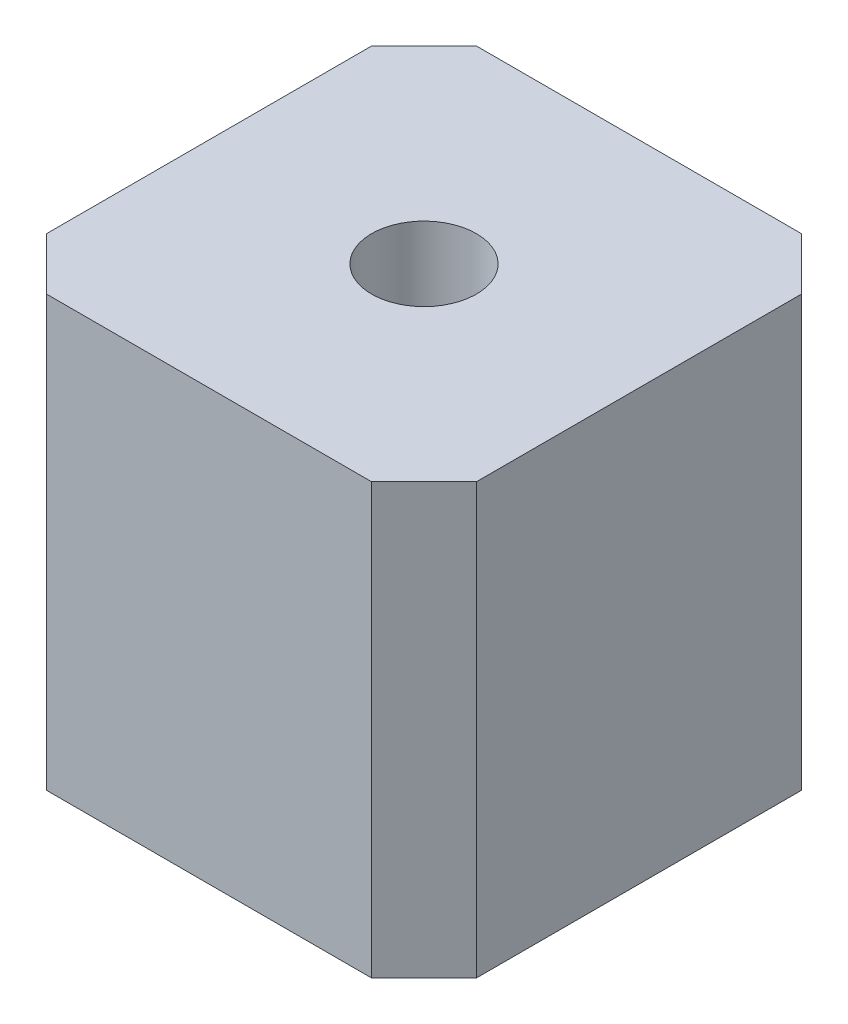
ISO-10303-21;
HEADER;
FILE_DESCRIPTION(('STEP AP214'),'2;1');
FILE_NAME('part.step','',(''),(''),'','','');
FILE_SCHEMA(('AUTOMOTIVE_DESIGN { 1 0 10303 214 1 1 1 1 }'));
ENDSEC;
DATA;
#1=APPLICATION_CONTEXT('core data for automotive mechanical design processes');
#2=APPLICATION_PROTOCOL_DEFINITION('international standard','automotive_design',2000,#1);
#3=PRODUCT_CONTEXT('',#1,'mechanical');
#4=PRODUCT('Part','Part','',(#3));
#5=PRODUCT_RELATED_PRODUCT_CATEGORY('part','',(#4));
#6=PRODUCT_DEFINITION_FORMATION('','',#4);
#7=PRODUCT_DEFINITION_CONTEXT('part definition',#1,'design');
#8=PRODUCT_DEFINITION('design','',#6,#7);
#9=PRODUCT_DEFINITION_SHAPE('','',#8);
#10=(LENGTH_UNIT() NAMED_UNIT(*) SI_UNIT(.MILLI.,.METRE.));
#11=(NAMED_UNIT(*) PLANE_ANGLE_UNIT() SI_UNIT($,.RADIAN.));
#12=(NAMED_UNIT(*) SI_UNIT($,.STERADIAN.) SOLID_ANGLE_UNIT());
#13=UNCERTAINTY_MEASURE_WITH_UNIT(LENGTH_MEASURE(1.E-05),#10,'distance_accuracy_value','');
#14=(GEOMETRIC_REPRESENTATION_CONTEXT(3) GLOBAL_UNCERTAINTY_ASSIGNED_CONTEXT((#13)) GLOBAL_UNIT_ASSIGNED_CONTEXT((#10,
#11,#12)) REPRESENTATION_CONTEXT('',''));
#15=CARTESIAN_POINT('',(0.,0.,0.));
#16=DIRECTION('',(0.,0.,1.));
#17=DIRECTION('',(1.,0.,0.));
#18=AXIS2_PLACEMENT_3D('',#15,#16,#17);
#19=CARTESIAN_POINT('',(20.5,41.,20.5));
#20=DIRECTION('',(-1.,0.,0.));
#21=DIRECTION('',(0.,0.,1.));
#22=AXIS2_PLACEMENT_3D('',#19,#20,#21);
#23=PLANE('',#22);
#24=DIRECTION('',(0.,0.,-1.));
#25=VECTOR('',#24,1.);
#26=CARTESIAN_POINT('',(20.5,41.,20.5));
#27=LINE('',#26,#25);
#28=CARTESIAN_POINT('',(20.5,41.,15.5));
#29=VERTEX_POINT('',#28);
#30=CARTESIAN_POINT('',(20.5,41.,-15.5));
#31=VERTEX_POINT('',#30);
#32=EDGE_CURVE('E126',#29,#31,#27,.T.);
#33=ORIENTED_EDGE('',*,*,#32,.F.);
#34=DIRECTION('',(0.,-1.,0.));
#35=VECTOR('',#34,1.);
#36=CARTESIAN_POINT('',(20.5,41.,15.5));
#37=LINE('',#36,#35);
#38=CARTESIAN_POINT('',(20.5,0.,15.5));
#39=VERTEX_POINT('',#38);
#40=EDGE_CURVE('E111',#29,#39,#37,.T.);
#41=ORIENTED_EDGE('',*,*,#40,.T.);
#42=DIRECTION('',(0.,0.,-1.));
#43=VECTOR('',#42,1.);
#44=CARTESIAN_POINT('',(20.5,0.,20.5));
#45=LINE('',#44,#43);
#46=CARTESIAN_POINT('',(20.5,0.,-15.5));
#47=VERTEX_POINT('',#46);
#48=EDGE_CURVE('E123',#39,#47,#45,.T.);
#49=ORIENTED_EDGE('',*,*,#48,.T.);
#50=DIRECTION('',(0.,1.,0.));
#51=VECTOR('',#50,1.);
#52=CARTESIAN_POINT('',(20.5,41.,-15.5));
#53=LINE('',#52,#51);
#54=EDGE_CURVE('E128',#47,#31,#53,.T.);
#55=ORIENTED_EDGE('',*,*,#54,.T.);
#56=EDGE_LOOP('',(#33,#41,#49,#55));
#57=FACE_BOUND('',#56,.T.);
#58=ADVANCED_FACE('F41',(#57),#23,.F.);
#59=CARTESIAN_POINT('',(-20.5,41.,-20.5));
#60=DIRECTION('',(0.,0.,1.));
#61=DIRECTION('',(1.,0.,0.));
#62=AXIS2_PLACEMENT_3D('',#59,#60,#61);
#63=PLANE('',#62);
#64=DIRECTION('',(-1.,0.,0.));
#65=VECTOR('',#64,1.);
#66=CARTESIAN_POINT('',(-20.5,41.,-20.5));
#67=LINE('',#66,#65);
#68=CARTESIAN_POINT('',(15.5,41.,-20.5));
#69=VERTEX_POINT('',#68);
#70=CARTESIAN_POINT('',(-15.5,41.,-20.5));
#71=VERTEX_POINT('',#70);
#72=EDGE_CURVE('E181',#69,#71,#67,.T.);
#73=ORIENTED_EDGE('',*,*,#72,.F.);
#74=DIRECTION('',(0.,-1.,0.));
#75=VECTOR('',#74,1.);
#76=CARTESIAN_POINT('',(15.5,41.,-20.5));
#77=LINE('',#76,#75);
#78=CARTESIAN_POINT('',(15.5,0.,-20.5));
#79=VERTEX_POINT('',#78);
#80=EDGE_CURVE('E165',#69,#79,#77,.T.);
#81=ORIENTED_EDGE('',*,*,#80,.T.);
#82=DIRECTION('',(-1.,0.,0.));
#83=VECTOR('',#82,1.);
#84=CARTESIAN_POINT('',(-20.5,0.,-20.5));
#85=LINE('',#84,#83);
#86=CARTESIAN_POINT('',(-15.5,0.,-20.5));
#87=VERTEX_POINT('',#86);
#88=EDGE_CURVE('E132',#79,#87,#85,.T.);
#89=ORIENTED_EDGE('',*,*,#88,.T.);
#90=DIRECTION('',(0.,1.,0.));
#91=VECTOR('',#90,1.);
#92=CARTESIAN_POINT('',(-15.5,41.,-20.5));
#93=LINE('',#92,#91);
#94=EDGE_CURVE('E163',#87,#71,#93,.T.);
#95=ORIENTED_EDGE('',*,*,#94,.T.);
#96=EDGE_LOOP('',(#73,#81,#89,#95));
#97=FACE_BOUND('',#96,.T.);
#98=ADVANCED_FACE('F203',(#97),#63,.F.);
#99=CARTESIAN_POINT('',(-20.5,41.,20.5));
#100=DIRECTION('',(1.,0.,0.));
#101=DIRECTION('',(0.,0.,-1.));
#102=AXIS2_PLACEMENT_3D('',#99,#100,#101);
#103=PLANE('',#102);
#104=DIRECTION('',(0.,0.,1.));
#105=VECTOR('',#104,1.);
#106=CARTESIAN_POINT('',(-20.5,0.,20.5));
#107=LINE('',#106,#105);
#108=CARTESIAN_POINT('',(-20.5,0.,-15.5));
#109=VERTEX_POINT('',#108);
#110=CARTESIAN_POINT('',(-20.5,0.,15.5));
#111=VERTEX_POINT('',#110);
#112=EDGE_CURVE('E136',#109,#111,#107,.T.);
#113=ORIENTED_EDGE('',*,*,#112,.T.);
#114=DIRECTION('',(0.,1.,0.));
#115=VECTOR('',#114,1.);
#116=CARTESIAN_POINT('',(-20.5,41.,15.5));
#117=LINE('',#116,#115);
#118=CARTESIAN_POINT('',(-20.5,41.,15.5));
#119=VERTEX_POINT('',#118);
#120=EDGE_CURVE('E11',#111,#119,#117,.T.);
#121=ORIENTED_EDGE('',*,*,#120,.T.);
#122=DIRECTION('',(0.,0.,1.));
#123=VECTOR('',#122,1.);
#124=CARTESIAN_POINT('',(-20.5,41.,20.5));
#125=LINE('',#124,#123);
#126=CARTESIAN_POINT('',(-20.5,41.,-15.5));
#127=VERTEX_POINT('',#126);
#128=EDGE_CURVE('E171',#127,#119,#125,.T.);
#129=ORIENTED_EDGE('',*,*,#128,.F.);
#130=DIRECTION('',(0.,-1.,0.));
#131=VECTOR('',#130,1.);
#132=CARTESIAN_POINT('',(-20.5,41.,-15.5));
#133=LINE('',#132,#131);
#134=EDGE_CURVE('E50',#127,#109,#133,.T.);
#135=ORIENTED_EDGE('',*,*,#134,.T.);
#136=EDGE_LOOP('',(#113,#121,#129,#135));
#137=FACE_BOUND('',#136,.T.);
#138=ADVANCED_FACE('F170',(#137),#103,.F.);
#139=CARTESIAN_POINT('',(-20.5,41.,20.5));
#140=DIRECTION('',(0.,0.,-1.));
#141=DIRECTION('',(-1.,0.,0.));
#142=AXIS2_PLACEMENT_3D('',#139,#140,#141);
#143=PLANE('',#142);
#144=DIRECTION('',(1.,0.,0.));
#145=VECTOR('',#144,1.);
#146=CARTESIAN_POINT('',(-20.5,0.,20.5));
#147=LINE('',#146,#145);
#148=CARTESIAN_POINT('',(-15.5,0.,20.5));
#149=VERTEX_POINT('',#148);
#150=CARTESIAN_POINT('',(15.5,0.,20.5));
#151=VERTEX_POINT('',#150);
#152=EDGE_CURVE('E146',#149,#151,#147,.T.);
#153=ORIENTED_EDGE('',*,*,#152,.T.);
#154=DIRECTION('',(0.,1.,0.));
#155=VECTOR('',#154,1.);
#156=CARTESIAN_POINT('',(15.5,41.,20.5));
#157=LINE('',#156,#155);
#158=CARTESIAN_POINT('',(15.5,41.,20.5));
#159=VERTEX_POINT('',#158);
#160=EDGE_CURVE('E112',#151,#159,#157,.T.);
#161=ORIENTED_EDGE('',*,*,#160,.T.);
#162=DIRECTION('',(1.,0.,0.));
#163=VECTOR('',#162,1.);
#164=CARTESIAN_POINT('',(-20.5,41.,20.5));
#165=LINE('',#164,#163);
#166=CARTESIAN_POINT('',(-15.5,41.,20.5));
#167=VERTEX_POINT('',#166);
#168=EDGE_CURVE('E142',#167,#159,#165,.T.);
#169=ORIENTED_EDGE('',*,*,#168,.F.);
#170=DIRECTION('',(0.,-1.,0.));
#171=VECTOR('',#170,1.);
#172=CARTESIAN_POINT('',(-15.5,41.,20.5));
#173=LINE('',#172,#171);
#174=EDGE_CURVE('E117',#167,#149,#173,.T.);
#175=ORIENTED_EDGE('',*,*,#174,.T.);
#176=EDGE_LOOP('',(#153,#161,#169,#175));
#177=FACE_BOUND('',#176,.T.);
#178=ADVANCED_FACE('F179',(#177),#143,.F.);
#179=CARTESIAN_POINT('',(0.,41.,0.));
#180=DIRECTION('',(0.,-1.,0.));
#181=DIRECTION('',(0.,0.,-1.));
#182=AXIS2_PLACEMENT_3D('',#179,#180,#181);
#183=PLANE('',#182);
#184=CARTESIAN_POINT('',(0.,41.,0.));
#185=DIRECTION('',(0.,-1.,0.));
#186=DIRECTION('',(0.,0.,-1.));
#187=AXIS2_PLACEMENT_3D('',#184,#185,#186);
#188=CIRCLE('',#187,5.);
#189=CARTESIAN_POINT('',(0.,41.,-5.));
#190=VERTEX_POINT('',#189);
#191=EDGE_CURVE('E133',#190,#190,#188,.T.);
#192=ORIENTED_EDGE('',*,*,#191,.T.);
#193=EDGE_LOOP('',(#192));
#194=FACE_BOUND('',#193,.T.);
#195=ORIENTED_EDGE('',*,*,#168,.T.);
#196=DIRECTION('',(-0.707106781186549,0.,0.707106781186547));
#197=VECTOR('',#196,1.);
#198=CARTESIAN_POINT('',(20.5,41.,15.5));
#199=LINE('',#198,#197);
#200=EDGE_CURVE('E161',#159,#29,#199,.F.);
#201=ORIENTED_EDGE('',*,*,#200,.T.);
#202=ORIENTED_EDGE('',*,*,#32,.T.);
#203=DIRECTION('',(0.707106781186547,0.,0.707106781186549));
#204=VECTOR('',#203,1.);
#205=CARTESIAN_POINT('',(15.5,41.,-20.5));
#206=LINE('',#205,#204);
#207=EDGE_CURVE('E159',#31,#69,#206,.F.);
#208=ORIENTED_EDGE('',*,*,#207,.T.);
#209=ORIENTED_EDGE('',*,*,#72,.T.);
#210=DIRECTION('',(0.707106781186549,0.,-0.707106781186546));
#211=VECTOR('',#210,1.);
#212=CARTESIAN_POINT('',(-20.5,41.,-15.5));
#213=LINE('',#212,#211);
#214=EDGE_CURVE('E62',#71,#127,#213,.F.);
#215=ORIENTED_EDGE('',*,*,#214,.T.);
#216=ORIENTED_EDGE('',*,*,#128,.T.);
#217=DIRECTION('',(-0.707106781186547,0.,-0.707106781186549));
#218=VECTOR('',#217,1.);
#219=CARTESIAN_POINT('',(-15.5,41.,20.5));
#220=LINE('',#219,#218);
#221=EDGE_CURVE('E157',#119,#167,#220,.F.);
#222=ORIENTED_EDGE('',*,*,#221,.T.);
#223=EDGE_LOOP('',(#195,#201,#202,#208,#209,#215,#216,#222));
#224=FACE_BOUND('',#223,.T.);
#225=ADVANCED_FACE('F191',(#194,#224),#183,.F.);
#226=CARTESIAN_POINT('',(0.,0.,0.));
#227=DIRECTION('',(0.,-1.,0.));
#228=DIRECTION('',(0.,0.,-1.));
#229=AXIS2_PLACEMENT_3D('',#226,#227,#228);
#230=PLANE('',#229);
#231=CARTESIAN_POINT('',(0.,0.,0.));
#232=DIRECTION('',(0.,-1.,0.));
#233=DIRECTION('',(0.,0.,-1.));
#234=AXIS2_PLACEMENT_3D('',#231,#232,#233);
#235=CIRCLE('',#234,5.);
#236=CARTESIAN_POINT('',(0.,0.,-5.));
#237=VERTEX_POINT('',#236);
#238=EDGE_CURVE('E139',#237,#237,#235,.T.);
#239=ORIENTED_EDGE('',*,*,#238,.F.);
#240=EDGE_LOOP('',(#239));
#241=FACE_BOUND('',#240,.T.);
#242=ORIENTED_EDGE('',*,*,#48,.F.);
#243=DIRECTION('',(0.707106781186549,0.,-0.707106781186547));
#244=VECTOR('',#243,1.);
#245=CARTESIAN_POINT('',(18.,0.,18.));
#246=LINE('',#245,#244);
#247=EDGE_CURVE('E107',#39,#151,#246,.F.);
#248=ORIENTED_EDGE('',*,*,#247,.T.);
#249=ORIENTED_EDGE('',*,*,#152,.F.);
#250=DIRECTION('',(0.707106781186547,0.,0.707106781186549));
#251=VECTOR('',#250,1.);
#252=CARTESIAN_POINT('',(-18.,0.,18.));
#253=LINE('',#252,#251);
#254=EDGE_CURVE('E150',#149,#111,#253,.F.);
#255=ORIENTED_EDGE('',*,*,#254,.T.);
#256=ORIENTED_EDGE('',*,*,#112,.F.);
#257=DIRECTION('',(-0.707106781186549,0.,0.707106781186546));
#258=VECTOR('',#257,1.);
#259=CARTESIAN_POINT('',(-18.,0.,-18.));
#260=LINE('',#259,#258);
#261=EDGE_CURVE('E127',#109,#87,#260,.F.);
#262=ORIENTED_EDGE('',*,*,#261,.T.);
#263=ORIENTED_EDGE('',*,*,#88,.F.);
#264=DIRECTION('',(-0.707106781186547,0.,-0.707106781186549));
#265=VECTOR('',#264,1.);
#266=CARTESIAN_POINT('',(18.,0.,-18.));
#267=LINE('',#266,#265);
#268=EDGE_CURVE('E118',#79,#47,#267,.F.);
#269=ORIENTED_EDGE('',*,*,#268,.T.);
#270=EDGE_LOOP('',(#242,#248,#249,#255,#256,#262,#263,#269));
#271=FACE_BOUND('',#270,.T.);
#272=ADVANCED_FACE('F130',(#241,#271),#230,.T.);
#273=CARTESIAN_POINT('',(20.5,41.,15.5));
#274=DIRECTION('',(-0.707106781186547,0.,-0.707106781186549));
#275=DIRECTION('',(0.,-1.,0.));
#276=AXIS2_PLACEMENT_3D('',#273,#274,#275);
#277=PLANE('',#276);
#278=ORIENTED_EDGE('',*,*,#200,.F.);
#279=ORIENTED_EDGE('',*,*,#160,.F.);
#280=ORIENTED_EDGE('',*,*,#247,.F.);
#281=ORIENTED_EDGE('',*,*,#40,.F.);
#282=EDGE_LOOP('',(#278,#279,#280,#281));
#283=FACE_BOUND('',#282,.T.);
#284=ADVANCED_FACE('F110',(#283),#277,.F.);
#285=CARTESIAN_POINT('',(15.5,41.,-20.5));
#286=DIRECTION('',(-0.707106781186548,0.,0.707106781186546));
#287=DIRECTION('',(0.,-1.,0.));
#288=AXIS2_PLACEMENT_3D('',#285,#286,#287);
#289=PLANE('',#288);
#290=ORIENTED_EDGE('',*,*,#207,.F.);
#291=ORIENTED_EDGE('',*,*,#54,.F.);
#292=ORIENTED_EDGE('',*,*,#268,.F.);
#293=ORIENTED_EDGE('',*,*,#80,.F.);
#294=EDGE_LOOP('',(#290,#291,#292,#293));
#295=FACE_BOUND('',#294,.T.);
#296=ADVANCED_FACE('F197',(#295),#289,.F.);
#297=CARTESIAN_POINT('',(-15.5,41.,20.5));
#298=DIRECTION('',(0.707106781186548,0.,-0.707106781186546));
#299=DIRECTION('',(0.,-1.,0.));
#300=AXIS2_PLACEMENT_3D('',#297,#298,#299);
#301=PLANE('',#300);
#302=ORIENTED_EDGE('',*,*,#221,.F.);
#303=ORIENTED_EDGE('',*,*,#120,.F.);
#304=ORIENTED_EDGE('',*,*,#254,.F.);
#305=ORIENTED_EDGE('',*,*,#174,.F.);
#306=EDGE_LOOP('',(#302,#303,#304,#305));
#307=FACE_BOUND('',#306,.T.);
#308=ADVANCED_FACE('F176',(#307),#301,.F.);
#309=CARTESIAN_POINT('',(-20.5,41.,-15.5));
#310=DIRECTION('',(0.707106781186546,0.,0.707106781186549));
#311=DIRECTION('',(0.,-1.,0.));
#312=AXIS2_PLACEMENT_3D('',#309,#310,#311);
#313=PLANE('',#312);
#314=ORIENTED_EDGE('',*,*,#214,.F.);
#315=ORIENTED_EDGE('',*,*,#94,.F.);
#316=ORIENTED_EDGE('',*,*,#261,.F.);
#317=ORIENTED_EDGE('',*,*,#134,.F.);
#318=EDGE_LOOP('',(#314,#315,#316,#317));
#319=FACE_BOUND('',#318,.T.);
#320=ADVANCED_FACE('F44',(#319),#313,.F.);
#321=CARTESIAN_POINT('',(0.,41.,0.));
#322=DIRECTION('',(0.,-1.,0.));
#323=DIRECTION('',(0.,0.,-1.));
#324=AXIS2_PLACEMENT_3D('',#321,#322,#323);
#325=CYLINDRICAL_SURFACE('',#324,5.);
#326=ORIENTED_EDGE('',*,*,#191,.F.);
#327=EDGE_LOOP('',(#326));
#328=FACE_BOUND('',#327,.T.);
#329=ORIENTED_EDGE('',*,*,#238,.T.);
#330=EDGE_LOOP('',(#329));
#331=FACE_BOUND('',#330,.T.);
#332=ADVANCED_FACE('F188',(#328,#331),#325,.F.);
#333=CLOSED_SHELL('',(#58,#98,#138,#178,#225,#272,#284,#296,#308,#320,#332));
#334=MANIFOLD_SOLID_BREP('B2',#333);
#335=ADVANCED_BREP_SHAPE_REPRESENTATION('',(#18,#334),#14);
#336=SHAPE_DEFINITION_REPRESENTATION(#9,#335);
ENDSEC;
END-ISO-10303-21;
